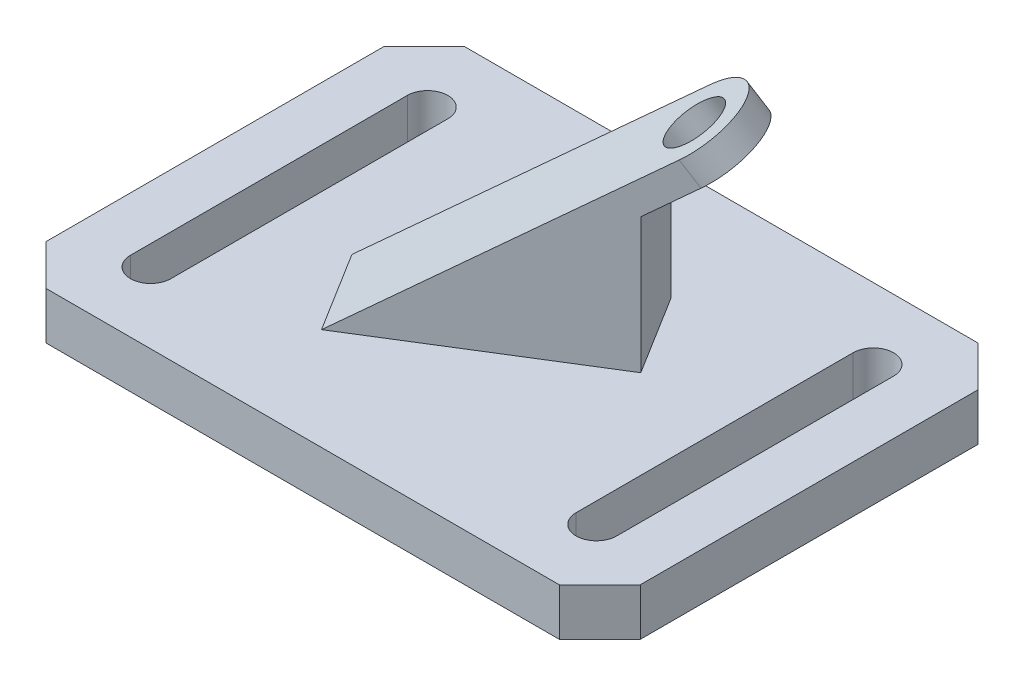
ISO-10303-21;
HEADER;
FILE_DESCRIPTION(('STEP AP214'),'2;1');
FILE_NAME('part.step','',(''),(''),'','','');
FILE_SCHEMA(('AUTOMOTIVE_DESIGN { 1 0 10303 214 1 1 1 1 }'));
ENDSEC;
DATA;
#1=APPLICATION_CONTEXT('core data for automotive mechanical design processes');
#2=APPLICATION_PROTOCOL_DEFINITION('international standard','automotive_design',2000,#1);
#3=PRODUCT_CONTEXT('',#1,'mechanical');
#4=PRODUCT('Part','Part','',(#3));
#5=PRODUCT_RELATED_PRODUCT_CATEGORY('part','',(#4));
#6=PRODUCT_DEFINITION_FORMATION('','',#4);
#7=PRODUCT_DEFINITION_CONTEXT('part definition',#1,'design');
#8=PRODUCT_DEFINITION('design','',#6,#7);
#9=PRODUCT_DEFINITION_SHAPE('','',#8);
#10=(LENGTH_UNIT() NAMED_UNIT(*) SI_UNIT(.MILLI.,.METRE.));
#11=(NAMED_UNIT(*) PLANE_ANGLE_UNIT() SI_UNIT($,.RADIAN.));
#12=(NAMED_UNIT(*) SI_UNIT($,.STERADIAN.) SOLID_ANGLE_UNIT());
#13=UNCERTAINTY_MEASURE_WITH_UNIT(LENGTH_MEASURE(1.E-05),#10,'distance_accuracy_value','');
#14=(GEOMETRIC_REPRESENTATION_CONTEXT(3) GLOBAL_UNCERTAINTY_ASSIGNED_CONTEXT((#13)) GLOBAL_UNIT_ASSIGNED_CONTEXT((#10,
#11,#12)) REPRESENTATION_CONTEXT('',''));
#15=CARTESIAN_POINT('',(0.,0.,0.));
#16=DIRECTION('',(0.,0.,1.));
#17=DIRECTION('',(1.,0.,0.));
#18=AXIS2_PLACEMENT_3D('',#15,#16,#17);
#19=CARTESIAN_POINT('',(-12.0530405447198,13.5448234370925,-0.753216279493183));
#20=DIRECTION('',(0.499289040047183,-0.809016994374951,-0.310164403665674));
#21=DIRECTION('',(0.850985081019819,0.525189862698903,0.));
#22=AXIS2_PLACEMENT_3D('',#19,#20,#21);
#23=PLANE('',#22);
#24=CARTESIAN_POINT('',(16.6531028262531,34.9383499958396,-10.3451093314603));
#25=DIRECTION('',(0.499289040047183,-0.809016994374951,-0.310164403665674));
#26=DIRECTION('',(0.850985081019819,0.525189862698903,0.));
#27=AXIS2_PLACEMENT_3D('',#24,#25,#26);
#28=CIRCLE('',#27,4.00000000000001);
#29=CARTESIAN_POINT('',(20.0570431503324,37.0391094466352,-10.3451093314603));
#30=VERTEX_POINT('',#29);
#31=EDGE_CURVE('E398',#30,#30,#28,.F.);
#32=ORIENTED_EDGE('',*,*,#31,.F.);
#33=EDGE_LOOP('',(#32));
#34=FACE_BOUND('',#33,.T.);
#35=DIRECTION('',(0.687212407810359,0.587785252292469,-0.426904677579162));
#36=VECTOR('',#35,1.);
#37=CARTESIAN_POINT('',(-4.6654757251132,13.5448234370925,11.1389612349955));
#38=LINE('',#37,#36);
#39=CARTESIAN_POINT('',(-12.3173925694985,7.,15.8924247292349));
#40=VERTEX_POINT('',#39);
#41=CARTESIAN_POINT('',(20.3468852360565,34.9383499958396,-4.39902057421595));
#42=VERTEX_POINT('',#41);
#43=EDGE_CURVE('E261',#40,#42,#38,.T.);
#44=ORIENTED_EDGE('',*,*,#43,.T.);
#45=CARTESIAN_POINT('',(16.6531028262531,34.9383499958396,-10.3451093314603));
#46=DIRECTION('',(0.499289040047183,-0.809016994374951,-0.310164403665674));
#47=DIRECTION('',(0.850985081019819,0.525189862698903,0.));
#48=AXIS2_PLACEMENT_3D('',#45,#46,#47);
#49=CIRCLE('',#48,7.);
#50=CARTESIAN_POINT('',(12.9593204164498,34.9383499958396,-16.2911980887047));
#51=VERTEX_POINT('',#50);
#52=EDGE_CURVE('E252',#42,#51,#49,.F.);
#53=ORIENTED_EDGE('',*,*,#52,.T.);
#54=DIRECTION('',(0.687212407810359,0.587785252292469,-0.426904677579162));
#55=VECTOR('',#54,1.);
#56=CARTESIAN_POINT('',(-12.0530405447198,13.5448234370925,-0.753216279493183));
#57=LINE('',#56,#55);
#58=CARTESIAN_POINT('',(-19.7049573891051,7.,4.00024721474619));
#59=VERTEX_POINT('',#58);
#60=EDGE_CURVE('E276',#59,#51,#57,.T.);
#61=ORIENTED_EDGE('',*,*,#60,.F.);
#62=DIRECTION('',(0.527683201400473,0.,0.849441251034907));
#63=VECTOR('',#62,1.);
#64=CARTESIAN_POINT('',(-19.7049573891051,7.,4.00024721474619));
#65=LINE('',#64,#63);
#66=EDGE_CURVE('E126',#59,#40,#65,.T.);
#67=ORIENTED_EDGE('',*,*,#66,.T.);
#68=EDGE_LOOP('',(#44,#53,#61,#67));
#69=FACE_BOUND('',#68,.T.);
#70=ADVANCED_FACE('F103',(#34,#69),#23,.F.);
#71=CARTESIAN_POINT('',(-10.0558843845311,10.3087554595927,-1.99387389415587));
#72=DIRECTION('',(-0.499289040047183,0.809016994374951,0.310164403665674));
#73=DIRECTION('',(-0.850985081019819,-0.525189862698903,0.));
#74=AXIS2_PLACEMENT_3D('',#71,#72,#73);
#75=PLANE('',#74);
#76=CARTESIAN_POINT('',(18.6502589864419,31.7022820183398,-11.585766946123));
#77=DIRECTION('',(-0.499289040047183,0.809016994374951,0.310164403665674));
#78=DIRECTION('',(-0.850985081019819,-0.525189862698903,0.));
#79=AXIS2_PLACEMENT_3D('',#76,#77,#78);
#80=CIRCLE('',#79,4.00000000000001);
#81=CARTESIAN_POINT('',(15.2463186623626,29.6015225675441,-11.585766946123));
#82=VERTEX_POINT('',#81);
#83=EDGE_CURVE('E396',#82,#82,#80,.F.);
#84=ORIENTED_EDGE('',*,*,#83,.F.);
#85=EDGE_LOOP('',(#84));
#86=FACE_BOUND('',#85,.T.);
#87=CARTESIAN_POINT('',(18.6502589864419,31.7022820183398,-11.585766946123));
#88=DIRECTION('',(-0.499289040047183,0.809016994374951,0.310164403665674));
#89=DIRECTION('',(-0.850985081019819,-0.525189862698903,0.));
#90=AXIS2_PLACEMENT_3D('',#87,#88,#89);
#91=CIRCLE('',#90,7.);
#92=CARTESIAN_POINT('',(14.9564765766386,31.7022820183398,-17.5318557033673));
#93=VERTEX_POINT('',#92);
#94=CARTESIAN_POINT('',(22.3440413962452,31.7022820183398,-5.63967818887865));
#95=VERTEX_POINT('',#94);
#96=EDGE_CURVE('E118',#93,#95,#91,.F.);
#97=ORIENTED_EDGE('',*,*,#96,.T.);
#98=DIRECTION('',(-0.687212407810359,-0.587785252292468,0.426904677579162));
#99=VECTOR('',#98,1.);
#100=CARTESIAN_POINT('',(-2.66831956492448,10.3087554595927,9.89830362033283));
#101=LINE('',#100,#99);
#102=CARTESIAN_POINT('',(16.8463421337623,27.,-2.22444076824533));
#103=VERTEX_POINT('',#102);
#104=EDGE_CURVE('E249',#95,#103,#101,.T.);
#105=ORIENTED_EDGE('',*,*,#104,.T.);
#106=DIRECTION('',(0.527683201400473,0.,0.849441251034907));
#107=VECTOR('',#106,1.);
#108=CARTESIAN_POINT('',(9.45877731415568,27.,-14.116618282734));
#109=LINE('',#108,#107);
#110=CARTESIAN_POINT('',(9.45877731415568,27.,-14.116618282734));
#111=VERTEX_POINT('',#110);
#112=EDGE_CURVE('E271',#111,#103,#109,.T.);
#113=ORIENTED_EDGE('',*,*,#112,.F.);
#114=DIRECTION('',(-0.687212407810359,-0.587785252292468,0.426904677579162));
#115=VECTOR('',#114,1.);
#116=CARTESIAN_POINT('',(-10.0558843845311,10.3087554595927,-1.99387389415587));
#117=LINE('',#116,#115);
#118=EDGE_CURVE('E251',#93,#111,#117,.T.);
#119=ORIENTED_EDGE('',*,*,#118,.F.);
#120=EDGE_LOOP('',(#97,#105,#113,#119));
#121=FACE_BOUND('',#120,.T.);
#122=ADVANCED_FACE('F246',(#86,#121),#75,.F.);
#123=CARTESIAN_POINT('',(3.69378240980331,0.,5.94608875724435));
#124=DIRECTION('',(0.527683201400473,0.,0.849441251034907));
#125=DIRECTION('',(0.849441251034907,0.,-0.527683201400473));
#126=AXIS2_PLACEMENT_3D('',#123,#124,#125);
#127=PLANE('',#126);
#128=ORIENTED_EDGE('',*,*,#104,.F.);
#129=DIRECTION('',(-0.499289040047183,0.80901699437495,0.310164403665675));
#130=VECTOR('',#129,1.);
#131=CARTESIAN_POINT('',(27.336931796717,23.6121120745903,-8.74132222553537));
#132=LINE('',#131,#130);
#133=EDGE_CURVE('E12',#95,#42,#132,.T.);
#134=ORIENTED_EDGE('',*,*,#133,.T.);
#135=ORIENTED_EDGE('',*,*,#43,.F.);
#136=DIRECTION('',(-0.849441251034907,0.,0.527683201400473));
#137=VECTOR('',#136,1.);
#138=CARTESIAN_POINT('',(3.69378240980331,7.,5.94608875724435));
#139=LINE('',#138,#137);
#140=CARTESIAN_POINT('',(16.8463421337623,7.,-2.22444076824533));
#141=VERTEX_POINT('',#140);
#142=EDGE_CURVE('E265',#141,#40,#139,.T.);
#143=ORIENTED_EDGE('',*,*,#142,.F.);
#144=DIRECTION('',(0.,-1.,0.));
#145=VECTOR('',#144,1.);
#146=CARTESIAN_POINT('',(16.8463421337623,0.,-2.22444076824533));
#147=LINE('',#146,#145);
#148=EDGE_CURVE('E260',#103,#141,#147,.T.);
#149=ORIENTED_EDGE('',*,*,#148,.F.);
#150=EDGE_LOOP('',(#128,#134,#135,#143,#149));
#151=FACE_BOUND('',#150,.T.);
#152=ADVANCED_FACE('F258',(#151),#127,.T.);
#153=CARTESIAN_POINT('',(-3.69378240980331,0.,-5.94608875724435));
#154=DIRECTION('',(0.527683201400473,0.,0.849441251034907));
#155=DIRECTION('',(0.849441251034907,0.,-0.527683201400473));
#156=AXIS2_PLACEMENT_3D('',#153,#154,#155);
#157=PLANE('',#156);
#158=DIRECTION('',(0.499289040047183,-0.80901699437495,-0.310164403665675));
#159=VECTOR('',#158,1.);
#160=CARTESIAN_POINT('',(-10.2256197489133,72.5057890999957,-1.88843222840332));
#161=LINE('',#160,#159);
#162=EDGE_CURVE('E111',#93,#51,#161,.F.);
#163=ORIENTED_EDGE('',*,*,#162,.F.);
#164=ORIENTED_EDGE('',*,*,#118,.T.);
#165=DIRECTION('',(0.,-1.,0.));
#166=VECTOR('',#165,1.);
#167=CARTESIAN_POINT('',(9.45877731415568,0.,-14.116618282734));
#168=LINE('',#167,#166);
#169=CARTESIAN_POINT('',(9.45877731415568,7.,-14.116618282734));
#170=VERTEX_POINT('',#169);
#171=EDGE_CURVE('E408',#111,#170,#168,.T.);
#172=ORIENTED_EDGE('',*,*,#171,.T.);
#173=DIRECTION('',(-0.849441251034907,0.,0.527683201400473));
#174=VECTOR('',#173,1.);
#175=CARTESIAN_POINT('',(-3.69378240980331,7.,-5.94608875724435));
#176=LINE('',#175,#174);
#177=EDGE_CURVE('E263',#170,#59,#176,.T.);
#178=ORIENTED_EDGE('',*,*,#177,.T.);
#179=ORIENTED_EDGE('',*,*,#60,.T.);
#180=EDGE_LOOP('',(#163,#164,#172,#178,#179));
#181=FACE_BOUND('',#180,.T.);
#182=ADVANCED_FACE('F468',(#181),#157,.F.);
#183=CARTESIAN_POINT('',(0.,7.,0.));
#184=DIRECTION('',(0.,-1.,0.));
#185=DIRECTION('',(0.,0.,-1.));
#186=AXIS2_PLACEMENT_3D('',#183,#184,#185);
#187=PLANE('',#186);
#188=CARTESIAN_POINT('',(33.,7.,20.5));
#189=DIRECTION('',(0.,1.,0.));
#190=DIRECTION('',(0.,0.,-1.));
#191=AXIS2_PLACEMENT_3D('',#188,#189,#190);
#192=CIRCLE('',#191,3.00000000000001);
#193=CARTESIAN_POINT('',(30.,7.,20.5));
#194=VERTEX_POINT('',#193);
#195=CARTESIAN_POINT('',(36.,7.,20.5));
#196=VERTEX_POINT('',#195);
#197=EDGE_CURVE('E277',#194,#196,#192,.T.);
#198=ORIENTED_EDGE('',*,*,#197,.F.);
#199=DIRECTION('',(0.,0.,1.));
#200=VECTOR('',#199,1.);
#201=CARTESIAN_POINT('',(30.,7.,20.5));
#202=LINE('',#201,#200);
#203=CARTESIAN_POINT('',(30.,7.,-20.5));
#204=VERTEX_POINT('',#203);
#205=EDGE_CURVE('E285',#204,#194,#202,.T.);
#206=ORIENTED_EDGE('',*,*,#205,.F.);
#207=CARTESIAN_POINT('',(33.,7.,-20.5));
#208=DIRECTION('',(0.,1.,0.));
#209=DIRECTION('',(0.,0.,-1.));
#210=AXIS2_PLACEMENT_3D('',#207,#208,#209);
#211=CIRCLE('',#210,3.00000000000001);
#212=CARTESIAN_POINT('',(36.,7.,-20.5));
#213=VERTEX_POINT('',#212);
#214=EDGE_CURVE('E282',#213,#204,#211,.T.);
#215=ORIENTED_EDGE('',*,*,#214,.F.);
#216=DIRECTION('',(0.,0.,-1.));
#217=VECTOR('',#216,1.);
#218=CARTESIAN_POINT('',(36.,7.,20.5));
#219=LINE('',#218,#217);
#220=EDGE_CURVE('E279',#196,#213,#219,.T.);
#221=ORIENTED_EDGE('',*,*,#220,.F.);
#222=EDGE_LOOP('',(#198,#206,#215,#221));
#223=FACE_BOUND('',#222,.T.);
#224=DIRECTION('',(0.,0.,1.));
#225=VECTOR('',#224,1.);
#226=CARTESIAN_POINT('',(-44.,7.,25.));
#227=LINE('',#226,#225);
#228=CARTESIAN_POINT('',(-44.,7.,-25.));
#229=VERTEX_POINT('',#228);
#230=CARTESIAN_POINT('',(-44.,7.,25.));
#231=VERTEX_POINT('',#230);
#232=EDGE_CURVE('E339',#229,#231,#227,.T.);
#233=ORIENTED_EDGE('',*,*,#232,.T.);
#234=DIRECTION('',(0.707106781186548,0.,0.707106781186548));
#235=VECTOR('',#234,1.);
#236=CARTESIAN_POINT('',(-44.,7.,25.));
#237=LINE('',#236,#235);
#238=CARTESIAN_POINT('',(-38.,7.,31.));
#239=VERTEX_POINT('',#238);
#240=EDGE_CURVE('E342',#231,#239,#237,.T.);
#241=ORIENTED_EDGE('',*,*,#240,.T.);
#242=DIRECTION('',(1.,0.,0.));
#243=VECTOR('',#242,1.);
#244=CARTESIAN_POINT('',(-38.,7.,31.));
#245=LINE('',#244,#243);
#246=CARTESIAN_POINT('',(38.,7.,31.));
#247=VERTEX_POINT('',#246);
#248=EDGE_CURVE('E345',#239,#247,#245,.T.);
#249=ORIENTED_EDGE('',*,*,#248,.T.);
#250=DIRECTION('',(0.707106781186548,0.,-0.707106781186548));
#251=VECTOR('',#250,1.);
#252=CARTESIAN_POINT('',(38.,7.,31.));
#253=LINE('',#252,#251);
#254=CARTESIAN_POINT('',(44.,7.,25.));
#255=VERTEX_POINT('',#254);
#256=EDGE_CURVE('E347',#247,#255,#253,.T.);
#257=ORIENTED_EDGE('',*,*,#256,.T.);
#258=DIRECTION('',(0.,0.,-1.));
#259=VECTOR('',#258,1.);
#260=CARTESIAN_POINT('',(44.,7.,25.));
#261=LINE('',#260,#259);
#262=CARTESIAN_POINT('',(44.,7.,-25.));
#263=VERTEX_POINT('',#262);
#264=EDGE_CURVE('E349',#255,#263,#261,.T.);
#265=ORIENTED_EDGE('',*,*,#264,.T.);
#266=DIRECTION('',(-0.707106781186548,0.,-0.707106781186548));
#267=VECTOR('',#266,1.);
#268=CARTESIAN_POINT('',(38.,7.,-31.));
#269=LINE('',#268,#267);
#270=CARTESIAN_POINT('',(38.,7.,-31.));
#271=VERTEX_POINT('',#270);
#272=EDGE_CURVE('E351',#263,#271,#269,.T.);
#273=ORIENTED_EDGE('',*,*,#272,.T.);
#274=DIRECTION('',(-1.,0.,0.));
#275=VECTOR('',#274,1.);
#276=CARTESIAN_POINT('',(-38.,7.,-31.));
#277=LINE('',#276,#275);
#278=CARTESIAN_POINT('',(-38.,7.,-31.));
#279=VERTEX_POINT('',#278);
#280=EDGE_CURVE('E353',#271,#279,#277,.T.);
#281=ORIENTED_EDGE('',*,*,#280,.T.);
#282=DIRECTION('',(-0.707106781186548,0.,0.707106781186548));
#283=VECTOR('',#282,1.);
#284=CARTESIAN_POINT('',(-44.,7.,-25.));
#285=LINE('',#284,#283);
#286=EDGE_CURVE('E355',#279,#229,#285,.T.);
#287=ORIENTED_EDGE('',*,*,#286,.T.);
#288=EDGE_LOOP('',(#233,#241,#249,#257,#265,#273,#281,#287));
#289=FACE_BOUND('',#288,.T.);
#290=CARTESIAN_POINT('',(-33.,7.,20.5));
#291=DIRECTION('',(0.,1.,0.));
#292=DIRECTION('',(0.,0.,1.));
#293=AXIS2_PLACEMENT_3D('',#290,#291,#292);
#294=CIRCLE('',#293,3.00000000000001);
#295=CARTESIAN_POINT('',(-36.,7.,20.5));
#296=VERTEX_POINT('',#295);
#297=CARTESIAN_POINT('',(-30.,7.,20.5));
#298=VERTEX_POINT('',#297);
#299=EDGE_CURVE('E308',#296,#298,#294,.T.);
#300=ORIENTED_EDGE('',*,*,#299,.F.);
#301=DIRECTION('',(0.,0.,1.));
#302=VECTOR('',#301,1.);
#303=CARTESIAN_POINT('',(-36.,7.,20.5));
#304=LINE('',#303,#302);
#305=CARTESIAN_POINT('',(-36.,7.,-20.5));
#306=VERTEX_POINT('',#305);
#307=EDGE_CURVE('E316',#306,#296,#304,.T.);
#308=ORIENTED_EDGE('',*,*,#307,.F.);
#309=CARTESIAN_POINT('',(-33.,7.,-20.5));
#310=DIRECTION('',(0.,1.,0.));
#311=DIRECTION('',(0.,0.,1.));
#312=AXIS2_PLACEMENT_3D('',#309,#310,#311);
#313=CIRCLE('',#312,3.00000000000001);
#314=CARTESIAN_POINT('',(-30.,7.,-20.5));
#315=VERTEX_POINT('',#314);
#316=EDGE_CURVE('E313',#315,#306,#313,.T.);
#317=ORIENTED_EDGE('',*,*,#316,.F.);
#318=DIRECTION('',(0.,0.,-1.));
#319=VECTOR('',#318,1.);
#320=CARTESIAN_POINT('',(-30.,7.,20.5));
#321=LINE('',#320,#319);
#322=EDGE_CURVE('E310',#298,#315,#321,.T.);
#323=ORIENTED_EDGE('',*,*,#322,.F.);
#324=EDGE_LOOP('',(#300,#308,#317,#323));
#325=FACE_BOUND('',#324,.T.);
#326=ORIENTED_EDGE('',*,*,#177,.F.);
#327=DIRECTION('',(0.527683201400473,0.,0.849441251034907));
#328=VECTOR('',#327,1.);
#329=CARTESIAN_POINT('',(9.45877731415568,7.,-14.116618282734));
#330=LINE('',#329,#328);
#331=EDGE_CURVE('E273',#170,#141,#330,.T.);
#332=ORIENTED_EDGE('',*,*,#331,.T.);
#333=ORIENTED_EDGE('',*,*,#142,.T.);
#334=ORIENTED_EDGE('',*,*,#66,.F.);
#335=EDGE_LOOP('',(#326,#332,#333,#334));
#336=FACE_BOUND('',#335,.T.);
#337=ADVANCED_FACE('F414',(#223,#289,#325,#336),#187,.F.);
#338=CARTESIAN_POINT('',(0.,0.,0.));
#339=DIRECTION('',(0.,-1.,0.));
#340=DIRECTION('',(0.,0.,-1.));
#341=AXIS2_PLACEMENT_3D('',#338,#339,#340);
#342=PLANE('',#341);
#343=DIRECTION('',(0.,0.,1.));
#344=VECTOR('',#343,1.);
#345=CARTESIAN_POINT('',(-44.,0.,25.));
#346=LINE('',#345,#344);
#347=CARTESIAN_POINT('',(-44.,0.,-25.));
#348=VERTEX_POINT('',#347);
#349=CARTESIAN_POINT('',(-44.,0.,25.));
#350=VERTEX_POINT('',#349);
#351=EDGE_CURVE('E338',#348,#350,#346,.T.);
#352=ORIENTED_EDGE('',*,*,#351,.F.);
#353=DIRECTION('',(-0.707106781186548,0.,0.707106781186548));
#354=VECTOR('',#353,1.);
#355=CARTESIAN_POINT('',(-44.,0.,-25.));
#356=LINE('',#355,#354);
#357=CARTESIAN_POINT('',(-38.,0.,-31.));
#358=VERTEX_POINT('',#357);
#359=EDGE_CURVE('E343',#358,#348,#356,.T.);
#360=ORIENTED_EDGE('',*,*,#359,.F.);
#361=DIRECTION('',(-1.,0.,0.));
#362=VECTOR('',#361,1.);
#363=CARTESIAN_POINT('',(-38.,0.,-31.));
#364=LINE('',#363,#362);
#365=CARTESIAN_POINT('',(38.,0.,-31.));
#366=VERTEX_POINT('',#365);
#367=EDGE_CURVE('E370',#366,#358,#364,.T.);
#368=ORIENTED_EDGE('',*,*,#367,.F.);
#369=DIRECTION('',(-0.707106781186548,0.,-0.707106781186548));
#370=VECTOR('',#369,1.);
#371=CARTESIAN_POINT('',(38.,0.,-31.));
#372=LINE('',#371,#370);
#373=CARTESIAN_POINT('',(44.,0.,-25.));
#374=VERTEX_POINT('',#373);
#375=EDGE_CURVE('E368',#374,#366,#372,.T.);
#376=ORIENTED_EDGE('',*,*,#375,.F.);
#377=DIRECTION('',(0.,0.,-1.));
#378=VECTOR('',#377,1.);
#379=CARTESIAN_POINT('',(44.,0.,25.));
#380=LINE('',#379,#378);
#381=CARTESIAN_POINT('',(44.,0.,25.));
#382=VERTEX_POINT('',#381);
#383=EDGE_CURVE('E366',#382,#374,#380,.T.);
#384=ORIENTED_EDGE('',*,*,#383,.F.);
#385=DIRECTION('',(0.707106781186548,0.,-0.707106781186548));
#386=VECTOR('',#385,1.);
#387=CARTESIAN_POINT('',(38.,0.,31.));
#388=LINE('',#387,#386);
#389=CARTESIAN_POINT('',(38.,0.,31.));
#390=VERTEX_POINT('',#389);
#391=EDGE_CURVE('E364',#390,#382,#388,.T.);
#392=ORIENTED_EDGE('',*,*,#391,.F.);
#393=DIRECTION('',(1.,0.,0.));
#394=VECTOR('',#393,1.);
#395=CARTESIAN_POINT('',(-38.,0.,31.));
#396=LINE('',#395,#394);
#397=CARTESIAN_POINT('',(-38.,0.,31.));
#398=VERTEX_POINT('',#397);
#399=EDGE_CURVE('E362',#398,#390,#396,.T.);
#400=ORIENTED_EDGE('',*,*,#399,.F.);
#401=DIRECTION('',(0.707106781186548,0.,0.707106781186548));
#402=VECTOR('',#401,1.);
#403=CARTESIAN_POINT('',(-44.,0.,25.));
#404=LINE('',#403,#402);
#405=EDGE_CURVE('E360',#350,#398,#404,.T.);
#406=ORIENTED_EDGE('',*,*,#405,.F.);
#407=EDGE_LOOP('',(#352,#360,#368,#376,#384,#392,#400,#406));
#408=FACE_BOUND('',#407,.T.);
#409=DIRECTION('',(0.,0.,1.));
#410=VECTOR('',#409,1.);
#411=CARTESIAN_POINT('',(-36.,0.,20.5));
#412=LINE('',#411,#410);
#413=CARTESIAN_POINT('',(-36.,0.,-20.5));
#414=VERTEX_POINT('',#413);
#415=CARTESIAN_POINT('',(-36.,0.,20.5));
#416=VERTEX_POINT('',#415);
#417=EDGE_CURVE('E311',#414,#416,#412,.T.);
#418=ORIENTED_EDGE('',*,*,#417,.T.);
#419=CARTESIAN_POINT('',(-33.,0.,20.5));
#420=DIRECTION('',(0.,1.,0.));
#421=DIRECTION('',(0.,0.,1.));
#422=AXIS2_PLACEMENT_3D('',#419,#420,#421);
#423=CIRCLE('',#422,3.00000000000001);
#424=CARTESIAN_POINT('',(-30.,0.,20.5));
#425=VERTEX_POINT('',#424);
#426=EDGE_CURVE('E307',#416,#425,#423,.T.);
#427=ORIENTED_EDGE('',*,*,#426,.T.);
#428=DIRECTION('',(0.,0.,-1.));
#429=VECTOR('',#428,1.);
#430=CARTESIAN_POINT('',(-30.,0.,20.5));
#431=LINE('',#430,#429);
#432=CARTESIAN_POINT('',(-30.,0.,-20.5));
#433=VERTEX_POINT('',#432);
#434=EDGE_CURVE('E321',#425,#433,#431,.T.);
#435=ORIENTED_EDGE('',*,*,#434,.T.);
#436=CARTESIAN_POINT('',(-33.,0.,-20.5));
#437=DIRECTION('',(0.,1.,0.));
#438=DIRECTION('',(0.,0.,1.));
#439=AXIS2_PLACEMENT_3D('',#436,#437,#438);
#440=CIRCLE('',#439,3.00000000000001);
#441=EDGE_CURVE('E324',#433,#414,#440,.T.);
#442=ORIENTED_EDGE('',*,*,#441,.T.);
#443=EDGE_LOOP('',(#418,#427,#435,#442));
#444=FACE_BOUND('',#443,.T.);
#445=DIRECTION('',(0.,0.,1.));
#446=VECTOR('',#445,1.);
#447=CARTESIAN_POINT('',(30.,0.,20.5));
#448=LINE('',#447,#446);
#449=CARTESIAN_POINT('',(30.,0.,-20.5));
#450=VERTEX_POINT('',#449);
#451=CARTESIAN_POINT('',(30.,0.,20.5));
#452=VERTEX_POINT('',#451);
#453=EDGE_CURVE('E280',#450,#452,#448,.T.);
#454=ORIENTED_EDGE('',*,*,#453,.T.);
#455=CARTESIAN_POINT('',(33.,0.,20.5));
#456=DIRECTION('',(0.,1.,0.));
#457=DIRECTION('',(0.,0.,-1.));
#458=AXIS2_PLACEMENT_3D('',#455,#456,#457);
#459=CIRCLE('',#458,3.00000000000001);
#460=CARTESIAN_POINT('',(36.,0.,20.5));
#461=VERTEX_POINT('',#460);
#462=EDGE_CURVE('E270',#452,#461,#459,.T.);
#463=ORIENTED_EDGE('',*,*,#462,.T.);
#464=DIRECTION('',(0.,0.,-1.));
#465=VECTOR('',#464,1.);
#466=CARTESIAN_POINT('',(36.,0.,20.5));
#467=LINE('',#466,#465);
#468=CARTESIAN_POINT('',(36.,0.,-20.5));
#469=VERTEX_POINT('',#468);
#470=EDGE_CURVE('E290',#461,#469,#467,.T.);
#471=ORIENTED_EDGE('',*,*,#470,.T.);
#472=CARTESIAN_POINT('',(33.,0.,-20.5));
#473=DIRECTION('',(0.,1.,0.));
#474=DIRECTION('',(0.,0.,-1.));
#475=AXIS2_PLACEMENT_3D('',#472,#473,#474);
#476=CIRCLE('',#475,3.00000000000001);
#477=EDGE_CURVE('E293',#469,#450,#476,.T.);
#478=ORIENTED_EDGE('',*,*,#477,.T.);
#479=EDGE_LOOP('',(#454,#463,#471,#478));
#480=FACE_BOUND('',#479,.T.);
#481=ADVANCED_FACE('F467',(#408,#444,#480),#342,.T.);
#482=CARTESIAN_POINT('',(-44.,7.,25.));
#483=DIRECTION('',(1.,0.,0.));
#484=DIRECTION('',(0.,0.,-1.));
#485=AXIS2_PLACEMENT_3D('',#482,#483,#484);
#486=PLANE('',#485);
#487=ORIENTED_EDGE('',*,*,#351,.T.);
#488=DIRECTION('',(0.,-1.,0.));
#489=VECTOR('',#488,1.);
#490=CARTESIAN_POINT('',(-44.,7.,25.));
#491=LINE('',#490,#489);
#492=EDGE_CURVE('E393',#231,#350,#491,.T.);
#493=ORIENTED_EDGE('',*,*,#492,.F.);
#494=ORIENTED_EDGE('',*,*,#232,.F.);
#495=DIRECTION('',(0.,-1.,0.));
#496=VECTOR('',#495,1.);
#497=CARTESIAN_POINT('',(-44.,7.,-25.));
#498=LINE('',#497,#496);
#499=EDGE_CURVE('E357',#229,#348,#498,.T.);
#500=ORIENTED_EDGE('',*,*,#499,.T.);
#501=EDGE_LOOP('',(#487,#493,#494,#500));
#502=FACE_BOUND('',#501,.T.);
#503=ADVANCED_FACE('F105',(#502),#486,.F.);
#504=CARTESIAN_POINT('',(-44.,7.,25.));
#505=DIRECTION('',(0.707106781186547,0.,-0.707106781186547));
#506=DIRECTION('',(-0.707106781186548,0.,-0.707106781186548));
#507=AXIS2_PLACEMENT_3D('',#504,#505,#506);
#508=PLANE('',#507);
#509=ORIENTED_EDGE('',*,*,#405,.T.);
#510=DIRECTION('',(0.,-1.,0.));
#511=VECTOR('',#510,1.);
#512=CARTESIAN_POINT('',(-38.,7.,31.));
#513=LINE('',#512,#511);
#514=EDGE_CURVE('E390',#239,#398,#513,.T.);
#515=ORIENTED_EDGE('',*,*,#514,.F.);
#516=ORIENTED_EDGE('',*,*,#240,.F.);
#517=ORIENTED_EDGE('',*,*,#492,.T.);
#518=EDGE_LOOP('',(#509,#515,#516,#517));
#519=FACE_BOUND('',#518,.T.);
#520=ADVANCED_FACE('F494',(#519),#508,.F.);
#521=CARTESIAN_POINT('',(-38.,7.,31.));
#522=DIRECTION('',(0.,0.,-1.));
#523=DIRECTION('',(-1.,0.,0.));
#524=AXIS2_PLACEMENT_3D('',#521,#522,#523);
#525=PLANE('',#524);
#526=ORIENTED_EDGE('',*,*,#399,.T.);
#527=DIRECTION('',(0.,-1.,0.));
#528=VECTOR('',#527,1.);
#529=CARTESIAN_POINT('',(38.,7.,31.));
#530=LINE('',#529,#528);
#531=EDGE_CURVE('E387',#247,#390,#530,.T.);
#532=ORIENTED_EDGE('',*,*,#531,.F.);
#533=ORIENTED_EDGE('',*,*,#248,.F.);
#534=ORIENTED_EDGE('',*,*,#514,.T.);
#535=EDGE_LOOP('',(#526,#532,#533,#534));
#536=FACE_BOUND('',#535,.T.);
#537=ADVANCED_FACE('F491',(#536),#525,.F.);
#538=CARTESIAN_POINT('',(38.,7.,31.));
#539=DIRECTION('',(-0.707106781186547,0.,-0.707106781186547));
#540=DIRECTION('',(-0.707106781186548,0.,0.707106781186548));
#541=AXIS2_PLACEMENT_3D('',#538,#539,#540);
#542=PLANE('',#541);
#543=ORIENTED_EDGE('',*,*,#391,.T.);
#544=DIRECTION('',(0.,-1.,0.));
#545=VECTOR('',#544,1.);
#546=CARTESIAN_POINT('',(44.,7.,25.));
#547=LINE('',#546,#545);
#548=EDGE_CURVE('E384',#255,#382,#547,.T.);
#549=ORIENTED_EDGE('',*,*,#548,.F.);
#550=ORIENTED_EDGE('',*,*,#256,.F.);
#551=ORIENTED_EDGE('',*,*,#531,.T.);
#552=EDGE_LOOP('',(#543,#549,#550,#551));
#553=FACE_BOUND('',#552,.T.);
#554=ADVANCED_FACE('F487',(#553),#542,.F.);
#555=CARTESIAN_POINT('',(44.,7.,25.));
#556=DIRECTION('',(-1.,0.,0.));
#557=DIRECTION('',(0.,0.,1.));
#558=AXIS2_PLACEMENT_3D('',#555,#556,#557);
#559=PLANE('',#558);
#560=ORIENTED_EDGE('',*,*,#383,.T.);
#561=DIRECTION('',(0.,-1.,0.));
#562=VECTOR('',#561,1.);
#563=CARTESIAN_POINT('',(44.,7.,-25.));
#564=LINE('',#563,#562);
#565=EDGE_CURVE('E381',#263,#374,#564,.T.);
#566=ORIENTED_EDGE('',*,*,#565,.F.);
#567=ORIENTED_EDGE('',*,*,#264,.F.);
#568=ORIENTED_EDGE('',*,*,#548,.T.);
#569=EDGE_LOOP('',(#560,#566,#567,#568));
#570=FACE_BOUND('',#569,.T.);
#571=ADVANCED_FACE('F483',(#570),#559,.F.);
#572=CARTESIAN_POINT('',(38.,7.,-31.));
#573=DIRECTION('',(-0.707106781186547,0.,0.707106781186547));
#574=DIRECTION('',(0.707106781186548,0.,0.707106781186548));
#575=AXIS2_PLACEMENT_3D('',#572,#573,#574);
#576=PLANE('',#575);
#577=ORIENTED_EDGE('',*,*,#375,.T.);
#578=DIRECTION('',(0.,-1.,0.));
#579=VECTOR('',#578,1.);
#580=CARTESIAN_POINT('',(38.,7.,-31.));
#581=LINE('',#580,#579);
#582=EDGE_CURVE('E378',#271,#366,#581,.T.);
#583=ORIENTED_EDGE('',*,*,#582,.F.);
#584=ORIENTED_EDGE('',*,*,#272,.F.);
#585=ORIENTED_EDGE('',*,*,#565,.T.);
#586=EDGE_LOOP('',(#577,#583,#584,#585));
#587=FACE_BOUND('',#586,.T.);
#588=ADVANCED_FACE('F479',(#587),#576,.F.);
#589=CARTESIAN_POINT('',(-38.,7.,-31.));
#590=DIRECTION('',(0.,0.,1.));
#591=DIRECTION('',(1.,0.,0.));
#592=AXIS2_PLACEMENT_3D('',#589,#590,#591);
#593=PLANE('',#592);
#594=ORIENTED_EDGE('',*,*,#367,.T.);
#595=DIRECTION('',(0.,-1.,0.));
#596=VECTOR('',#595,1.);
#597=CARTESIAN_POINT('',(-38.,7.,-31.));
#598=LINE('',#597,#596);
#599=EDGE_CURVE('E375',#279,#358,#598,.T.);
#600=ORIENTED_EDGE('',*,*,#599,.F.);
#601=ORIENTED_EDGE('',*,*,#280,.F.);
#602=ORIENTED_EDGE('',*,*,#582,.T.);
#603=EDGE_LOOP('',(#594,#600,#601,#602));
#604=FACE_BOUND('',#603,.T.);
#605=ADVANCED_FACE('F475',(#604),#593,.F.);
#606=CARTESIAN_POINT('',(-44.,7.,-25.));
#607=DIRECTION('',(0.707106781186547,0.,0.707106781186547));
#608=DIRECTION('',(0.707106781186548,0.,-0.707106781186548));
#609=AXIS2_PLACEMENT_3D('',#606,#607,#608);
#610=PLANE('',#609);
#611=ORIENTED_EDGE('',*,*,#359,.T.);
#612=ORIENTED_EDGE('',*,*,#499,.F.);
#613=ORIENTED_EDGE('',*,*,#286,.F.);
#614=ORIENTED_EDGE('',*,*,#599,.T.);
#615=EDGE_LOOP('',(#611,#612,#613,#614));
#616=FACE_BOUND('',#615,.T.);
#617=ADVANCED_FACE('F463',(#616),#610,.F.);
#618=CARTESIAN_POINT('',(-33.,7.,20.5));
#619=DIRECTION('',(0.,-1.,0.));
#620=DIRECTION('',(0.,0.,-1.));
#621=AXIS2_PLACEMENT_3D('',#618,#619,#620);
#622=CYLINDRICAL_SURFACE('',#621,3.00000000000001);
#623=ORIENTED_EDGE('',*,*,#426,.F.);
#624=DIRECTION('',(0.,-1.,0.));
#625=VECTOR('',#624,1.);
#626=CARTESIAN_POINT('',(-36.,7.,20.5));
#627=LINE('',#626,#625);
#628=EDGE_CURVE('E318',#296,#416,#627,.T.);
#629=ORIENTED_EDGE('',*,*,#628,.F.);
#630=ORIENTED_EDGE('',*,*,#299,.T.);
#631=DIRECTION('',(0.,-1.,0.));
#632=VECTOR('',#631,1.);
#633=CARTESIAN_POINT('',(-30.,7.,20.5));
#634=LINE('',#633,#632);
#635=EDGE_CURVE('E335',#298,#425,#634,.T.);
#636=ORIENTED_EDGE('',*,*,#635,.T.);
#637=EDGE_LOOP('',(#623,#629,#630,#636));
#638=FACE_BOUND('',#637,.T.);
#639=ADVANCED_FACE('F459',(#638),#622,.F.);
#640=CARTESIAN_POINT('',(-30.,7.,20.5));
#641=DIRECTION('',(-1.,0.,0.));
#642=DIRECTION('',(0.,0.,1.));
#643=AXIS2_PLACEMENT_3D('',#640,#641,#642);
#644=PLANE('',#643);
#645=ORIENTED_EDGE('',*,*,#434,.F.);
#646=ORIENTED_EDGE('',*,*,#635,.F.);
#647=ORIENTED_EDGE('',*,*,#322,.T.);
#648=DIRECTION('',(0.,-1.,0.));
#649=VECTOR('',#648,1.);
#650=CARTESIAN_POINT('',(-30.,7.,-20.5));
#651=LINE('',#650,#649);
#652=EDGE_CURVE('E333',#315,#433,#651,.T.);
#653=ORIENTED_EDGE('',*,*,#652,.T.);
#654=EDGE_LOOP('',(#645,#646,#647,#653));
#655=FACE_BOUND('',#654,.T.);
#656=ADVANCED_FACE('F455',(#655),#644,.T.);
#657=CARTESIAN_POINT('',(-33.,7.,-20.5));
#658=DIRECTION('',(0.,-1.,0.));
#659=DIRECTION('',(0.,0.,-1.));
#660=AXIS2_PLACEMENT_3D('',#657,#658,#659);
#661=CYLINDRICAL_SURFACE('',#660,3.00000000000001);
#662=ORIENTED_EDGE('',*,*,#441,.F.);
#663=ORIENTED_EDGE('',*,*,#652,.F.);
#664=ORIENTED_EDGE('',*,*,#316,.T.);
#665=DIRECTION('',(0.,-1.,0.));
#666=VECTOR('',#665,1.);
#667=CARTESIAN_POINT('',(-36.,7.,-20.5));
#668=LINE('',#667,#666);
#669=EDGE_CURVE('E331',#306,#414,#668,.T.);
#670=ORIENTED_EDGE('',*,*,#669,.T.);
#671=EDGE_LOOP('',(#662,#663,#664,#670));
#672=FACE_BOUND('',#671,.T.);
#673=ADVANCED_FACE('F451',(#672),#661,.F.);
#674=CARTESIAN_POINT('',(-36.,7.,20.5));
#675=DIRECTION('',(1.,0.,0.));
#676=DIRECTION('',(0.,0.,-1.));
#677=AXIS2_PLACEMENT_3D('',#674,#675,#676);
#678=PLANE('',#677);
#679=ORIENTED_EDGE('',*,*,#417,.F.);
#680=ORIENTED_EDGE('',*,*,#669,.F.);
#681=ORIENTED_EDGE('',*,*,#307,.T.);
#682=ORIENTED_EDGE('',*,*,#628,.T.);
#683=EDGE_LOOP('',(#679,#680,#681,#682));
#684=FACE_BOUND('',#683,.T.);
#685=ADVANCED_FACE('F447',(#684),#678,.T.);
#686=CARTESIAN_POINT('',(33.,7.,20.5));
#687=DIRECTION('',(0.,-1.,0.));
#688=DIRECTION('',(0.,0.,-1.));
#689=AXIS2_PLACEMENT_3D('',#686,#687,#688);
#690=CYLINDRICAL_SURFACE('',#689,3.00000000000001);
#691=ORIENTED_EDGE('',*,*,#462,.F.);
#692=DIRECTION('',(0.,-1.,0.));
#693=VECTOR('',#692,1.);
#694=CARTESIAN_POINT('',(30.,7.,20.5));
#695=LINE('',#694,#693);
#696=EDGE_CURVE('E287',#194,#452,#695,.T.);
#697=ORIENTED_EDGE('',*,*,#696,.F.);
#698=ORIENTED_EDGE('',*,*,#197,.T.);
#699=DIRECTION('',(0.,-1.,0.));
#700=VECTOR('',#699,1.);
#701=CARTESIAN_POINT('',(36.,7.,20.5));
#702=LINE('',#701,#700);
#703=EDGE_CURVE('E304',#196,#461,#702,.T.);
#704=ORIENTED_EDGE('',*,*,#703,.T.);
#705=EDGE_LOOP('',(#691,#697,#698,#704));
#706=FACE_BOUND('',#705,.T.);
#707=ADVANCED_FACE('F443',(#706),#690,.F.);
#708=CARTESIAN_POINT('',(36.,7.,20.5));
#709=DIRECTION('',(-1.,0.,0.));
#710=DIRECTION('',(0.,0.,1.));
#711=AXIS2_PLACEMENT_3D('',#708,#709,#710);
#712=PLANE('',#711);
#713=ORIENTED_EDGE('',*,*,#470,.F.);
#714=ORIENTED_EDGE('',*,*,#703,.F.);
#715=ORIENTED_EDGE('',*,*,#220,.T.);
#716=DIRECTION('',(0.,-1.,0.));
#717=VECTOR('',#716,1.);
#718=CARTESIAN_POINT('',(36.,7.,-20.5));
#719=LINE('',#718,#717);
#720=EDGE_CURVE('E302',#213,#469,#719,.T.);
#721=ORIENTED_EDGE('',*,*,#720,.T.);
#722=EDGE_LOOP('',(#713,#714,#715,#721));
#723=FACE_BOUND('',#722,.T.);
#724=ADVANCED_FACE('F439',(#723),#712,.T.);
#725=CARTESIAN_POINT('',(33.,7.,-20.5));
#726=DIRECTION('',(0.,-1.,0.));
#727=DIRECTION('',(0.,0.,-1.));
#728=AXIS2_PLACEMENT_3D('',#725,#726,#727);
#729=CYLINDRICAL_SURFACE('',#728,3.00000000000001);
#730=ORIENTED_EDGE('',*,*,#477,.F.);
#731=ORIENTED_EDGE('',*,*,#720,.F.);
#732=ORIENTED_EDGE('',*,*,#214,.T.);
#733=DIRECTION('',(0.,-1.,0.));
#734=VECTOR('',#733,1.);
#735=CARTESIAN_POINT('',(30.,7.,-20.5));
#736=LINE('',#735,#734);
#737=EDGE_CURVE('E300',#204,#450,#736,.T.);
#738=ORIENTED_EDGE('',*,*,#737,.T.);
#739=EDGE_LOOP('',(#730,#731,#732,#738));
#740=FACE_BOUND('',#739,.T.);
#741=ADVANCED_FACE('F435',(#740),#729,.F.);
#742=CARTESIAN_POINT('',(30.,7.,20.5));
#743=DIRECTION('',(1.,0.,0.));
#744=DIRECTION('',(0.,0.,-1.));
#745=AXIS2_PLACEMENT_3D('',#742,#743,#744);
#746=PLANE('',#745);
#747=ORIENTED_EDGE('',*,*,#453,.F.);
#748=ORIENTED_EDGE('',*,*,#737,.F.);
#749=ORIENTED_EDGE('',*,*,#205,.T.);
#750=ORIENTED_EDGE('',*,*,#696,.T.);
#751=EDGE_LOOP('',(#747,#748,#749,#750));
#752=FACE_BOUND('',#751,.T.);
#753=ADVANCED_FACE('F431',(#752),#746,.T.);
#754=CARTESIAN_POINT('',(9.45877731415568,0.,-14.116618282734));
#755=DIRECTION('',(-0.849441251034907,0.,0.527683201400473));
#756=DIRECTION('',(0.527683201400473,0.,0.849441251034907));
#757=AXIS2_PLACEMENT_3D('',#754,#755,#756);
#758=PLANE('',#757);
#759=ORIENTED_EDGE('',*,*,#148,.T.);
#760=ORIENTED_EDGE('',*,*,#331,.F.);
#761=ORIENTED_EDGE('',*,*,#171,.F.);
#762=ORIENTED_EDGE('',*,*,#112,.T.);
#763=EDGE_LOOP('',(#759,#760,#761,#762));
#764=FACE_BOUND('',#763,.T.);
#765=ADVANCED_FACE('F428',(#764),#758,.F.);
#766=CARTESIAN_POINT('',(-6.53183733910995,72.5057890999957,4.05765652884104));
#767=DIRECTION('',(0.499289040047183,-0.80901699437495,-0.310164403665675));
#768=DIRECTION('',(0.850985081019819,0.525189862698903,0.));
#769=AXIS2_PLACEMENT_3D('',#766,#767,#768);
#770=CYLINDRICAL_SURFACE('',#769,7.);
#771=ORIENTED_EDGE('',*,*,#52,.F.);
#772=ORIENTED_EDGE('',*,*,#133,.F.);
#773=ORIENTED_EDGE('',*,*,#96,.F.);
#774=ORIENTED_EDGE('',*,*,#162,.T.);
#775=EDGE_LOOP('',(#771,#772,#773,#774));
#776=FACE_BOUND('',#775,.T.);
#777=ADVANCED_FACE('F254',(#776),#770,.T.);
#778=CARTESIAN_POINT('',(-6.53183733910995,72.5057890999957,4.05765652884104));
#779=DIRECTION('',(0.499289040047183,-0.80901699437495,-0.310164403665675));
#780=DIRECTION('',(0.850985081019819,0.525189862698903,0.));
#781=AXIS2_PLACEMENT_3D('',#778,#779,#780);
#782=CYLINDRICAL_SURFACE('',#781,4.00000000000001);
#783=ORIENTED_EDGE('',*,*,#83,.T.);
#784=EDGE_LOOP('',(#783));
#785=FACE_BOUND('',#784,.T.);
#786=ORIENTED_EDGE('',*,*,#31,.T.);
#787=EDGE_LOOP('',(#786));
#788=FACE_BOUND('',#787,.T.);
#789=ADVANCED_FACE('F598',(#785,#788),#782,.F.);
#790=CLOSED_SHELL('',(#70,#122,#152,#182,#337,#481,#503,#520,#537,#554,#571,#588,#605,#617,#639,
#656,#673,#685,#707,#724,#741,#753,#765,#777,#789));
#791=MANIFOLD_SOLID_BREP('B2',#790);
#792=ADVANCED_BREP_SHAPE_REPRESENTATION('',(#18,#791),#14);
#793=SHAPE_DEFINITION_REPRESENTATION(#9,#792);
ENDSEC;
END-ISO-10303-21;
